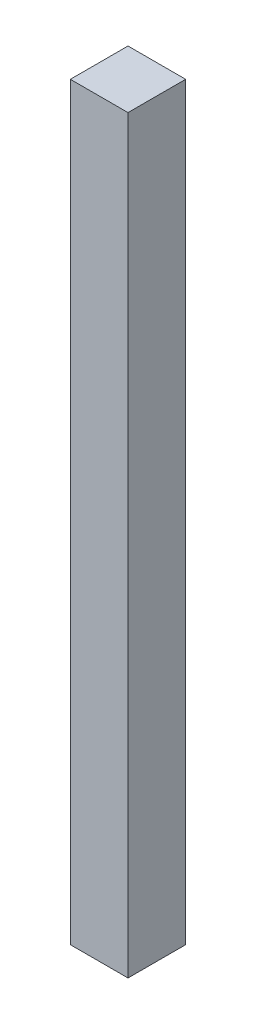
ISO-10303-21;
HEADER;
FILE_DESCRIPTION(('STEP AP214'),'2;1');
FILE_NAME('part.step','',(''),(''),'','','');
FILE_SCHEMA(('AUTOMOTIVE_DESIGN { 1 0 10303 214 1 1 1 1 }'));
ENDSEC;
DATA;
#1=APPLICATION_CONTEXT('core data for automotive mechanical design processes');
#2=APPLICATION_PROTOCOL_DEFINITION('international standard','automotive_design',2000,#1);
#3=PRODUCT_CONTEXT('',#1,'mechanical');
#4=PRODUCT('Part','Part','',(#3));
#5=PRODUCT_RELATED_PRODUCT_CATEGORY('part','',(#4));
#6=PRODUCT_DEFINITION_FORMATION('','',#4);
#7=PRODUCT_DEFINITION_CONTEXT('part definition',#1,'design');
#8=PRODUCT_DEFINITION('design','',#6,#7);
#9=PRODUCT_DEFINITION_SHAPE('','',#8);
#10=(LENGTH_UNIT() NAMED_UNIT(*) SI_UNIT(.MILLI.,.METRE.));
#11=(NAMED_UNIT(*) PLANE_ANGLE_UNIT() SI_UNIT($,.RADIAN.));
#12=(NAMED_UNIT(*) SI_UNIT($,.STERADIAN.) SOLID_ANGLE_UNIT());
#13=UNCERTAINTY_MEASURE_WITH_UNIT(LENGTH_MEASURE(1.E-05),#10,'distance_accuracy_value','');
#14=(GEOMETRIC_REPRESENTATION_CONTEXT(3) GLOBAL_UNCERTAINTY_ASSIGNED_CONTEXT((#13)) GLOBAL_UNIT_ASSIGNED_CONTEXT((#10,
#11,#12)) REPRESENTATION_CONTEXT('',''));
#15=CARTESIAN_POINT('',(0.,0.,0.));
#16=DIRECTION('',(0.,0.,1.));
#17=DIRECTION('',(1.,0.,0.));
#18=AXIS2_PLACEMENT_3D('',#15,#16,#17);
#19=CARTESIAN_POINT('',(0.,260.,0.));
#20=DIRECTION('',(-1.,0.,0.));
#21=DIRECTION('',(0.,0.,1.));
#22=AXIS2_PLACEMENT_3D('',#19,#20,#21);
#23=PLANE('',#22);
#24=DIRECTION('',(0.,0.,-1.));
#25=VECTOR('',#24,1.);
#26=CARTESIAN_POINT('',(0.,0.,0.));
#27=LINE('',#26,#25);
#28=CARTESIAN_POINT('',(0.,0.,0.));
#29=VERTEX_POINT('',#28);
#30=CARTESIAN_POINT('',(0.,0.,-20.));
#31=VERTEX_POINT('',#30);
#32=EDGE_CURVE('E96',#29,#31,#27,.T.);
#33=ORIENTED_EDGE('',*,*,#32,.T.);
#34=DIRECTION('',(0.,-1.,0.));
#35=VECTOR('',#34,1.);
#36=CARTESIAN_POINT('',(0.,260.,-20.));
#37=LINE('',#36,#35);
#38=CARTESIAN_POINT('',(0.,260.,-20.));
#39=VERTEX_POINT('',#38);
#40=EDGE_CURVE('E11',#39,#31,#37,.T.);
#41=ORIENTED_EDGE('',*,*,#40,.F.);
#42=DIRECTION('',(0.,0.,-1.));
#43=VECTOR('',#42,1.);
#44=CARTESIAN_POINT('',(0.,260.,0.));
#45=LINE('',#44,#43);
#46=CARTESIAN_POINT('',(0.,260.,0.));
#47=VERTEX_POINT('',#46);
#48=EDGE_CURVE('E84',#47,#39,#45,.T.);
#49=ORIENTED_EDGE('',*,*,#48,.F.);
#50=DIRECTION('',(0.,-1.,0.));
#51=VECTOR('',#50,1.);
#52=CARTESIAN_POINT('',(0.,260.,0.));
#53=LINE('',#52,#51);
#54=EDGE_CURVE('E92',#47,#29,#53,.T.);
#55=ORIENTED_EDGE('',*,*,#54,.T.);
#56=EDGE_LOOP('',(#33,#41,#49,#55));
#57=FACE_BOUND('',#56,.T.);
#58=ADVANCED_FACE('F33',(#57),#23,.F.);
#59=CARTESIAN_POINT('',(0.,260.,-20.));
#60=DIRECTION('',(0.,0.,1.));
#61=DIRECTION('',(1.,0.,0.));
#62=AXIS2_PLACEMENT_3D('',#59,#60,#61);
#63=PLANE('',#62);
#64=DIRECTION('',(-1.,0.,0.));
#65=VECTOR('',#64,1.);
#66=CARTESIAN_POINT('',(0.,0.,-20.));
#67=LINE('',#66,#65);
#68=CARTESIAN_POINT('',(-20.,0.,-20.));
#69=VERTEX_POINT('',#68);
#70=EDGE_CURVE('E88',#31,#69,#67,.T.);
#71=ORIENTED_EDGE('',*,*,#70,.T.);
#72=DIRECTION('',(0.,-1.,0.));
#73=VECTOR('',#72,1.);
#74=CARTESIAN_POINT('',(-20.,260.,-20.));
#75=LINE('',#74,#73);
#76=CARTESIAN_POINT('',(-20.,260.,-20.));
#77=VERTEX_POINT('',#76);
#78=EDGE_CURVE('E41',#77,#69,#75,.T.);
#79=ORIENTED_EDGE('',*,*,#78,.F.);
#80=DIRECTION('',(-1.,0.,0.));
#81=VECTOR('',#80,1.);
#82=CARTESIAN_POINT('',(0.,260.,-20.));
#83=LINE('',#82,#81);
#84=EDGE_CURVE('E79',#39,#77,#83,.T.);
#85=ORIENTED_EDGE('',*,*,#84,.F.);
#86=ORIENTED_EDGE('',*,*,#40,.T.);
#87=EDGE_LOOP('',(#71,#79,#85,#86));
#88=FACE_BOUND('',#87,.T.);
#89=ADVANCED_FACE('F87',(#88),#63,.F.);
#90=CARTESIAN_POINT('',(-20.,260.,0.));
#91=DIRECTION('',(1.,0.,0.));
#92=DIRECTION('',(0.,0.,-1.));
#93=AXIS2_PLACEMENT_3D('',#90,#91,#92);
#94=PLANE('',#93);
#95=DIRECTION('',(0.,0.,1.));
#96=VECTOR('',#95,1.);
#97=CARTESIAN_POINT('',(-20.,0.,0.));
#98=LINE('',#97,#96);
#99=CARTESIAN_POINT('',(-20.,0.,0.));
#100=VERTEX_POINT('',#99);
#101=EDGE_CURVE('E66',#69,#100,#98,.T.);
#102=ORIENTED_EDGE('',*,*,#101,.T.);
#103=DIRECTION('',(0.,-1.,0.));
#104=VECTOR('',#103,1.);
#105=CARTESIAN_POINT('',(-20.,260.,0.));
#106=LINE('',#105,#104);
#107=CARTESIAN_POINT('',(-20.,260.,0.));
#108=VERTEX_POINT('',#107);
#109=EDGE_CURVE('E89',#108,#100,#106,.T.);
#110=ORIENTED_EDGE('',*,*,#109,.F.);
#111=DIRECTION('',(0.,0.,1.));
#112=VECTOR('',#111,1.);
#113=CARTESIAN_POINT('',(-20.,260.,0.));
#114=LINE('',#113,#112);
#115=EDGE_CURVE('E82',#77,#108,#114,.T.);
#116=ORIENTED_EDGE('',*,*,#115,.F.);
#117=ORIENTED_EDGE('',*,*,#78,.T.);
#118=EDGE_LOOP('',(#102,#110,#116,#117));
#119=FACE_BOUND('',#118,.T.);
#120=ADVANCED_FACE('F90',(#119),#94,.F.);
#121=CARTESIAN_POINT('',(0.,260.,0.));
#122=DIRECTION('',(0.,0.,-1.));
#123=DIRECTION('',(-1.,0.,0.));
#124=AXIS2_PLACEMENT_3D('',#121,#122,#123);
#125=PLANE('',#124);
#126=DIRECTION('',(1.,0.,0.));
#127=VECTOR('',#126,1.);
#128=CARTESIAN_POINT('',(0.,0.,0.));
#129=LINE('',#128,#127);
#130=EDGE_CURVE('E72',#100,#29,#129,.T.);
#131=ORIENTED_EDGE('',*,*,#130,.T.);
#132=ORIENTED_EDGE('',*,*,#54,.F.);
#133=DIRECTION('',(1.,0.,0.));
#134=VECTOR('',#133,1.);
#135=CARTESIAN_POINT('',(0.,260.,0.));
#136=LINE('',#135,#134);
#137=EDGE_CURVE('E49',#108,#47,#136,.T.);
#138=ORIENTED_EDGE('',*,*,#137,.F.);
#139=ORIENTED_EDGE('',*,*,#109,.T.);
#140=EDGE_LOOP('',(#131,#132,#138,#139));
#141=FACE_BOUND('',#140,.T.);
#142=ADVANCED_FACE('F103',(#141),#125,.F.);
#143=CARTESIAN_POINT('',(0.,260.,0.));
#144=DIRECTION('',(0.,1.,0.));
#145=DIRECTION('',(0.,0.,1.));
#146=AXIS2_PLACEMENT_3D('',#143,#144,#145);
#147=PLANE('',#146);
#148=ORIENTED_EDGE('',*,*,#48,.T.);
#149=ORIENTED_EDGE('',*,*,#84,.T.);
#150=ORIENTED_EDGE('',*,*,#115,.T.);
#151=ORIENTED_EDGE('',*,*,#137,.T.);
#152=EDGE_LOOP('',(#148,#149,#150,#151));
#153=FACE_BOUND('',#152,.T.);
#154=ADVANCED_FACE('F80',(#153),#147,.T.);
#155=CARTESIAN_POINT('',(0.,0.,0.));
#156=DIRECTION('',(0.,1.,0.));
#157=DIRECTION('',(0.,0.,1.));
#158=AXIS2_PLACEMENT_3D('',#155,#156,#157);
#159=PLANE('',#158);
#160=ORIENTED_EDGE('',*,*,#32,.F.);
#161=ORIENTED_EDGE('',*,*,#130,.F.);
#162=ORIENTED_EDGE('',*,*,#101,.F.);
#163=ORIENTED_EDGE('',*,*,#70,.F.);
#164=EDGE_LOOP('',(#160,#161,#162,#163));
#165=FACE_BOUND('',#164,.T.);
#166=ADVANCED_FACE('F106',(#165),#159,.F.);
#167=CLOSED_SHELL('',(#58,#89,#120,#142,#154,#166));
#168=MANIFOLD_SOLID_BREP('B2',#167);
#169=ADVANCED_BREP_SHAPE_REPRESENTATION('',(#18,#168),#14);
#170=SHAPE_DEFINITION_REPRESENTATION(#9,#169);
ENDSEC;
END-ISO-10303-21;
